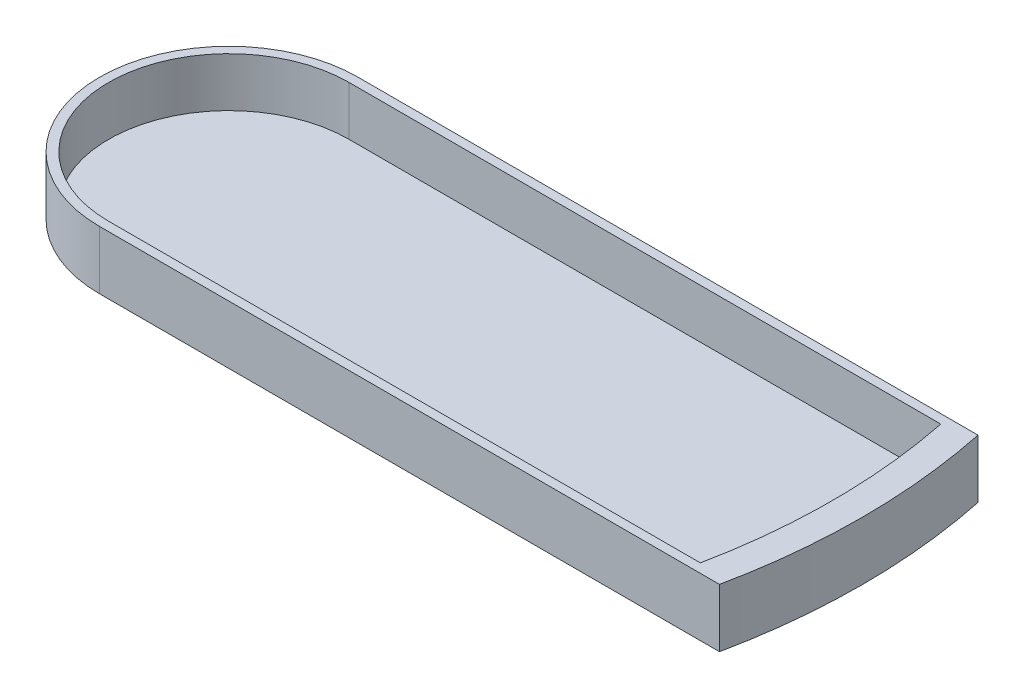
ISO-10303-21;
HEADER;
FILE_DESCRIPTION(('STEP AP214'),'2;1');
FILE_NAME('part.step','',(''),(''),'','','');
FILE_SCHEMA(('AUTOMOTIVE_DESIGN { 1 0 10303 214 1 1 1 1 }'));
ENDSEC;
DATA;
#1=APPLICATION_CONTEXT('core data for automotive mechanical design processes');
#2=APPLICATION_PROTOCOL_DEFINITION('international standard','automotive_design',2000,#1);
#3=PRODUCT_CONTEXT('',#1,'mechanical');
#4=PRODUCT('Part','Part','',(#3));
#5=PRODUCT_RELATED_PRODUCT_CATEGORY('part','',(#4));
#6=PRODUCT_DEFINITION_FORMATION('','',#4);
#7=PRODUCT_DEFINITION_CONTEXT('part definition',#1,'design');
#8=PRODUCT_DEFINITION('design','',#6,#7);
#9=PRODUCT_DEFINITION_SHAPE('','',#8);
#10=(LENGTH_UNIT() NAMED_UNIT(*) SI_UNIT(.MILLI.,.METRE.));
#11=(NAMED_UNIT(*) PLANE_ANGLE_UNIT() SI_UNIT($,.RADIAN.));
#12=(NAMED_UNIT(*) SI_UNIT($,.STERADIAN.) SOLID_ANGLE_UNIT());
#13=UNCERTAINTY_MEASURE_WITH_UNIT(LENGTH_MEASURE(1.E-05),#10,'distance_accuracy_value','');
#14=(GEOMETRIC_REPRESENTATION_CONTEXT(3) GLOBAL_UNCERTAINTY_ASSIGNED_CONTEXT((#13)) GLOBAL_UNIT_ASSIGNED_CONTEXT((#10,
#11,#12)) REPRESENTATION_CONTEXT('',''));
#15=CARTESIAN_POINT('',(0.,0.,0.));
#16=DIRECTION('',(0.,0.,1.));
#17=DIRECTION('',(1.,0.,0.));
#18=AXIS2_PLACEMENT_3D('',#15,#16,#17);
#19=CARTESIAN_POINT('',(0.,-2.,-28.575));
#20=DIRECTION('',(0.,0.,1.));
#21=DIRECTION('',(1.,0.,0.));
#22=AXIS2_PLACEMENT_3D('',#19,#20,#21);
#23=PLANE('',#22);
#24=DIRECTION('',(0.,1.,0.));
#25=VECTOR('',#24,1.);
#26=CARTESIAN_POINT('',(0.,-2.,-28.575));
#27=LINE('',#26,#25);
#28=CARTESIAN_POINT('',(0.,-2.,-28.575));
#29=VERTEX_POINT('',#28);
#30=CARTESIAN_POINT('',(0.,10.9,-28.575));
#31=VERTEX_POINT('',#30);
#32=EDGE_CURVE('E98',#29,#31,#27,.T.);
#33=ORIENTED_EDGE('',*,*,#32,.T.);
#34=DIRECTION('',(1.,0.,0.));
#35=VECTOR('',#34,1.);
#36=CARTESIAN_POINT('',(0.,10.9,-28.575));
#37=LINE('',#36,#35);
#38=CARTESIAN_POINT('',(137.052797764219,10.9,-28.575));
#39=VERTEX_POINT('',#38);
#40=EDGE_CURVE('E189',#31,#39,#37,.T.);
#41=ORIENTED_EDGE('',*,*,#40,.T.);
#42=DIRECTION('',(0.,1.,0.));
#43=VECTOR('',#42,1.);
#44=CARTESIAN_POINT('',(137.052797764219,-2.,-28.575));
#45=LINE('',#44,#43);
#46=CARTESIAN_POINT('',(137.052797764219,-2.,-28.575));
#47=VERTEX_POINT('',#46);
#48=EDGE_CURVE('E14',#47,#39,#45,.T.);
#49=ORIENTED_EDGE('',*,*,#48,.F.);
#50=DIRECTION('',(1.,0.,0.));
#51=VECTOR('',#50,1.);
#52=CARTESIAN_POINT('',(0.,-2.,-28.575));
#53=LINE('',#52,#51);
#54=EDGE_CURVE('E192',#29,#47,#53,.T.);
#55=ORIENTED_EDGE('',*,*,#54,.F.);
#56=EDGE_LOOP('',(#33,#41,#49,#55));
#57=FACE_BOUND('',#56,.T.);
#58=ADVANCED_FACE('F76',(#57),#23,.F.);
#59=CARTESIAN_POINT('',(0.,-2.,0.));
#60=DIRECTION('',(0.,1.,0.));
#61=DIRECTION('',(0.,0.,1.));
#62=AXIS2_PLACEMENT_3D('',#59,#60,#61);
#63=CYLINDRICAL_SURFACE('',#62,140.);
#64=ORIENTED_EDGE('',*,*,#48,.T.);
#65=CARTESIAN_POINT('',(0.,10.9,0.));
#66=DIRECTION('',(0.,-1.,0.));
#67=DIRECTION('',(0.,0.,-1.));
#68=AXIS2_PLACEMENT_3D('',#65,#66,#67);
#69=CIRCLE('',#68,140.);
#70=CARTESIAN_POINT('',(137.052797764219,10.9,28.5750000000014));
#71=VERTEX_POINT('',#70);
#72=EDGE_CURVE('E186',#39,#71,#69,.T.);
#73=ORIENTED_EDGE('',*,*,#72,.T.);
#74=DIRECTION('',(0.,1.,0.));
#75=VECTOR('',#74,1.);
#76=CARTESIAN_POINT('',(137.052797764219,-2.,28.5750000000014));
#77=LINE('',#76,#75);
#78=CARTESIAN_POINT('',(137.052797764219,-2.,28.5750000000014));
#79=VERTEX_POINT('',#78);
#80=EDGE_CURVE('E83',#79,#71,#77,.T.);
#81=ORIENTED_EDGE('',*,*,#80,.F.);
#82=CARTESIAN_POINT('',(0.,-2.,0.));
#83=DIRECTION('',(0.,1.,0.));
#84=DIRECTION('',(0.,0.,1.));
#85=AXIS2_PLACEMENT_3D('',#82,#83,#84);
#86=CIRCLE('',#85,140.);
#87=EDGE_CURVE('E194',#79,#47,#86,.T.);
#88=ORIENTED_EDGE('',*,*,#87,.T.);
#89=EDGE_LOOP('',(#64,#73,#81,#88));
#90=FACE_BOUND('',#89,.T.);
#91=ADVANCED_FACE('F213',(#90),#63,.T.);
#92=CARTESIAN_POINT('',(0.,-2.,28.575));
#93=DIRECTION('',(0.,0.,1.));
#94=DIRECTION('',(1.,0.,0.));
#95=AXIS2_PLACEMENT_3D('',#92,#93,#94);
#96=PLANE('',#95);
#97=ORIENTED_EDGE('',*,*,#80,.T.);
#98=DIRECTION('',(1.,0.,0.));
#99=VECTOR('',#98,1.);
#100=CARTESIAN_POINT('',(0.,10.9,28.575));
#101=LINE('',#100,#99);
#102=CARTESIAN_POINT('',(0.,10.9,28.575));
#103=VERTEX_POINT('',#102);
#104=EDGE_CURVE('E183',#103,#71,#101,.T.);
#105=ORIENTED_EDGE('',*,*,#104,.F.);
#106=DIRECTION('',(0.,1.,0.));
#107=VECTOR('',#106,1.);
#108=CARTESIAN_POINT('',(0.,-2.,28.575));
#109=LINE('',#108,#107);
#110=CARTESIAN_POINT('',(0.,-2.,28.575));
#111=VERTEX_POINT('',#110);
#112=EDGE_CURVE('E203',#111,#103,#109,.T.);
#113=ORIENTED_EDGE('',*,*,#112,.F.);
#114=DIRECTION('',(1.,0.,0.));
#115=VECTOR('',#114,1.);
#116=CARTESIAN_POINT('',(0.,-2.,28.575));
#117=LINE('',#116,#115);
#118=EDGE_CURVE('E197',#111,#79,#117,.T.);
#119=ORIENTED_EDGE('',*,*,#118,.T.);
#120=EDGE_LOOP('',(#97,#105,#113,#119));
#121=FACE_BOUND('',#120,.T.);
#122=ADVANCED_FACE('F207',(#121),#96,.T.);
#123=CARTESIAN_POINT('',(0.,-2.,0.));
#124=DIRECTION('',(0.,1.,0.));
#125=DIRECTION('',(0.,0.,1.));
#126=AXIS2_PLACEMENT_3D('',#123,#124,#125);
#127=CYLINDRICAL_SURFACE('',#126,28.575);
#128=ORIENTED_EDGE('',*,*,#112,.T.);
#129=CARTESIAN_POINT('',(0.,10.9,0.));
#130=DIRECTION('',(0.,1.,0.));
#131=DIRECTION('',(0.,0.,1.));
#132=AXIS2_PLACEMENT_3D('',#129,#130,#131);
#133=CIRCLE('',#132,28.575);
#134=EDGE_CURVE('E158',#31,#103,#133,.T.);
#135=ORIENTED_EDGE('',*,*,#134,.F.);
#136=ORIENTED_EDGE('',*,*,#32,.F.);
#137=CARTESIAN_POINT('',(0.,-2.,0.));
#138=DIRECTION('',(0.,1.,0.));
#139=DIRECTION('',(0.,0.,1.));
#140=AXIS2_PLACEMENT_3D('',#137,#138,#139);
#141=CIRCLE('',#140,28.575);
#142=EDGE_CURVE('E200',#29,#111,#141,.T.);
#143=ORIENTED_EDGE('',*,*,#142,.T.);
#144=EDGE_LOOP('',(#128,#135,#136,#143));
#145=FACE_BOUND('',#144,.T.);
#146=ADVANCED_FACE('F217',(#145),#127,.T.);
#147=CARTESIAN_POINT('',(0.,-2.,0.));
#148=DIRECTION('',(0.,1.,0.));
#149=DIRECTION('',(0.,0.,1.));
#150=AXIS2_PLACEMENT_3D('',#147,#148,#149);
#151=PLANE('',#150);
#152=ORIENTED_EDGE('',*,*,#54,.T.);
#153=ORIENTED_EDGE('',*,*,#87,.F.);
#154=ORIENTED_EDGE('',*,*,#118,.F.);
#155=ORIENTED_EDGE('',*,*,#142,.F.);
#156=EDGE_LOOP('',(#152,#153,#154,#155));
#157=FACE_BOUND('',#156,.T.);
#158=ADVANCED_FACE('F219',(#157),#151,.F.);
#159=CARTESIAN_POINT('',(0.,10.9,0.));
#160=DIRECTION('',(0.,1.,0.));
#161=DIRECTION('',(0.,0.,1.));
#162=AXIS2_PLACEMENT_3D('',#159,#160,#161);
#163=PLANE('',#162);
#164=ORIENTED_EDGE('',*,*,#134,.T.);
#165=ORIENTED_EDGE('',*,*,#104,.T.);
#166=ORIENTED_EDGE('',*,*,#72,.F.);
#167=ORIENTED_EDGE('',*,*,#40,.F.);
#168=EDGE_LOOP('',(#164,#165,#166,#167));
#169=FACE_BOUND('',#168,.T.);
#170=DIRECTION('',(1.,0.,0.));
#171=VECTOR('',#170,1.);
#172=CARTESIAN_POINT('',(0.,10.9,26.575));
#173=LINE('',#172,#171);
#174=CARTESIAN_POINT('',(0.,10.9,26.575));
#175=VERTEX_POINT('',#174);
#176=CARTESIAN_POINT('',(130.828205578919,10.9,26.575));
#177=VERTEX_POINT('',#176);
#178=EDGE_CURVE('E149',#175,#177,#173,.T.);
#179=ORIENTED_EDGE('',*,*,#178,.F.);
#180=CARTESIAN_POINT('',(0.,10.9,0.));
#181=DIRECTION('',(0.,1.,0.));
#182=DIRECTION('',(0.,0.,1.));
#183=AXIS2_PLACEMENT_3D('',#180,#181,#182);
#184=CIRCLE('',#183,26.575);
#185=CARTESIAN_POINT('',(0.,10.9,-26.575));
#186=VERTEX_POINT('',#185);
#187=EDGE_CURVE('E141',#186,#175,#184,.T.);
#188=ORIENTED_EDGE('',*,*,#187,.F.);
#189=DIRECTION('',(1.,0.,0.));
#190=VECTOR('',#189,1.);
#191=CARTESIAN_POINT('',(0.,10.9,-26.575));
#192=LINE('',#191,#190);
#193=CARTESIAN_POINT('',(130.828205578919,10.9,-26.575));
#194=VERTEX_POINT('',#193);
#195=EDGE_CURVE('E166',#186,#194,#192,.T.);
#196=ORIENTED_EDGE('',*,*,#195,.T.);
#197=CARTESIAN_POINT('',(0.,10.9,0.));
#198=DIRECTION('',(0.,-1.,0.));
#199=DIRECTION('',(0.,0.,-1.));
#200=AXIS2_PLACEMENT_3D('',#197,#198,#199);
#201=CIRCLE('',#200,133.5);
#202=EDGE_CURVE('E164',#194,#177,#201,.T.);
#203=ORIENTED_EDGE('',*,*,#202,.T.);
#204=EDGE_LOOP('',(#179,#188,#196,#203));
#205=FACE_BOUND('',#204,.T.);
#206=ADVANCED_FACE('F162',(#169,#205),#163,.T.);
#207=CARTESIAN_POINT('',(0.,10.9,0.));
#208=DIRECTION('',(0.,-1.,0.));
#209=DIRECTION('',(0.,0.,-1.));
#210=AXIS2_PLACEMENT_3D('',#207,#208,#209);
#211=CYLINDRICAL_SURFACE('',#210,26.575);
#212=CARTESIAN_POINT('',(0.,0.,0.));
#213=DIRECTION('',(0.,1.,0.));
#214=DIRECTION('',(0.,0.,1.));
#215=AXIS2_PLACEMENT_3D('',#212,#213,#214);
#216=CIRCLE('',#215,26.575);
#217=CARTESIAN_POINT('',(0.,0.,-26.575));
#218=VERTEX_POINT('',#217);
#219=CARTESIAN_POINT('',(0.,0.,26.575));
#220=VERTEX_POINT('',#219);
#221=EDGE_CURVE('E170',#218,#220,#216,.T.);
#222=ORIENTED_EDGE('',*,*,#221,.F.);
#223=DIRECTION('',(0.,-1.,0.));
#224=VECTOR('',#223,1.);
#225=CARTESIAN_POINT('',(0.,10.9,-26.575));
#226=LINE('',#225,#224);
#227=EDGE_CURVE('E90',#186,#218,#226,.T.);
#228=ORIENTED_EDGE('',*,*,#227,.F.);
#229=ORIENTED_EDGE('',*,*,#187,.T.);
#230=DIRECTION('',(0.,-1.,0.));
#231=VECTOR('',#230,1.);
#232=CARTESIAN_POINT('',(0.,10.9,26.575));
#233=LINE('',#232,#231);
#234=EDGE_CURVE('E144',#175,#220,#233,.T.);
#235=ORIENTED_EDGE('',*,*,#234,.T.);
#236=EDGE_LOOP('',(#222,#228,#229,#235));
#237=FACE_BOUND('',#236,.T.);
#238=ADVANCED_FACE('F143',(#237),#211,.F.);
#239=CARTESIAN_POINT('',(0.,10.9,26.575));
#240=DIRECTION('',(0.,0.,-1.));
#241=DIRECTION('',(-1.,0.,0.));
#242=AXIS2_PLACEMENT_3D('',#239,#240,#241);
#243=PLANE('',#242);
#244=DIRECTION('',(1.,0.,0.));
#245=VECTOR('',#244,1.);
#246=CARTESIAN_POINT('',(0.,0.,26.575));
#247=LINE('',#246,#245);
#248=CARTESIAN_POINT('',(130.828205578919,0.,26.575));
#249=VERTEX_POINT('',#248);
#250=EDGE_CURVE('E157',#220,#249,#247,.T.);
#251=ORIENTED_EDGE('',*,*,#250,.F.);
#252=ORIENTED_EDGE('',*,*,#234,.F.);
#253=ORIENTED_EDGE('',*,*,#178,.T.);
#254=DIRECTION('',(0.,-1.,0.));
#255=VECTOR('',#254,1.);
#256=CARTESIAN_POINT('',(130.828205578919,10.9,26.575));
#257=LINE('',#256,#255);
#258=EDGE_CURVE('E159',#177,#249,#257,.T.);
#259=ORIENTED_EDGE('',*,*,#258,.T.);
#260=EDGE_LOOP('',(#251,#252,#253,#259));
#261=FACE_BOUND('',#260,.T.);
#262=ADVANCED_FACE('F153',(#261),#243,.T.);
#263=CARTESIAN_POINT('',(0.,10.9,0.));
#264=DIRECTION('',(0.,-1.,0.));
#265=DIRECTION('',(0.,0.,-1.));
#266=AXIS2_PLACEMENT_3D('',#263,#264,#265);
#267=CYLINDRICAL_SURFACE('',#266,133.5);
#268=CARTESIAN_POINT('',(0.,0.,0.));
#269=DIRECTION('',(0.,1.,0.));
#270=DIRECTION('',(0.,0.,1.));
#271=AXIS2_PLACEMENT_3D('',#268,#269,#270);
#272=CIRCLE('',#271,133.5);
#273=CARTESIAN_POINT('',(130.828205578919,0.,-26.575));
#274=VERTEX_POINT('',#273);
#275=EDGE_CURVE('E173',#249,#274,#272,.T.);
#276=ORIENTED_EDGE('',*,*,#275,.F.);
#277=ORIENTED_EDGE('',*,*,#258,.F.);
#278=ORIENTED_EDGE('',*,*,#202,.F.);
#279=DIRECTION('',(0.,-1.,0.));
#280=VECTOR('',#279,1.);
#281=CARTESIAN_POINT('',(130.828205578919,10.9,-26.575));
#282=LINE('',#281,#280);
#283=EDGE_CURVE('E178',#194,#274,#282,.T.);
#284=ORIENTED_EDGE('',*,*,#283,.T.);
#285=EDGE_LOOP('',(#276,#277,#278,#284));
#286=FACE_BOUND('',#285,.T.);
#287=ADVANCED_FACE('F244',(#286),#267,.F.);
#288=CARTESIAN_POINT('',(0.,10.9,-26.575));
#289=DIRECTION('',(0.,0.,-1.));
#290=DIRECTION('',(-1.,0.,0.));
#291=AXIS2_PLACEMENT_3D('',#288,#289,#290);
#292=PLANE('',#291);
#293=DIRECTION('',(1.,0.,0.));
#294=VECTOR('',#293,1.);
#295=CARTESIAN_POINT('',(0.,0.,-26.575));
#296=LINE('',#295,#294);
#297=EDGE_CURVE('E150',#218,#274,#296,.T.);
#298=ORIENTED_EDGE('',*,*,#297,.T.);
#299=ORIENTED_EDGE('',*,*,#283,.F.);
#300=ORIENTED_EDGE('',*,*,#195,.F.);
#301=ORIENTED_EDGE('',*,*,#227,.T.);
#302=EDGE_LOOP('',(#298,#299,#300,#301));
#303=FACE_BOUND('',#302,.T.);
#304=ADVANCED_FACE('F239',(#303),#292,.F.);
#305=CARTESIAN_POINT('',(0.,0.,0.));
#306=DIRECTION('',(0.,1.,0.));
#307=DIRECTION('',(0.,0.,1.));
#308=AXIS2_PLACEMENT_3D('',#305,#306,#307);
#309=PLANE('',#308);
#310=ORIENTED_EDGE('',*,*,#221,.T.);
#311=ORIENTED_EDGE('',*,*,#250,.T.);
#312=ORIENTED_EDGE('',*,*,#275,.T.);
#313=ORIENTED_EDGE('',*,*,#297,.F.);
#314=EDGE_LOOP('',(#310,#311,#312,#313));
#315=FACE_BOUND('',#314,.T.);
#316=ADVANCED_FACE('F237',(#315),#309,.T.);
#317=CLOSED_SHELL('',(#58,#91,#122,#146,#158,#206,#238,#262,#287,#304,#316));
#318=MANIFOLD_SOLID_BREP('B2',#317);
#319=ADVANCED_BREP_SHAPE_REPRESENTATION('',(#18,#318),#14);
#320=SHAPE_DEFINITION_REPRESENTATION(#9,#319);
ENDSEC;
END-ISO-10303-21;
